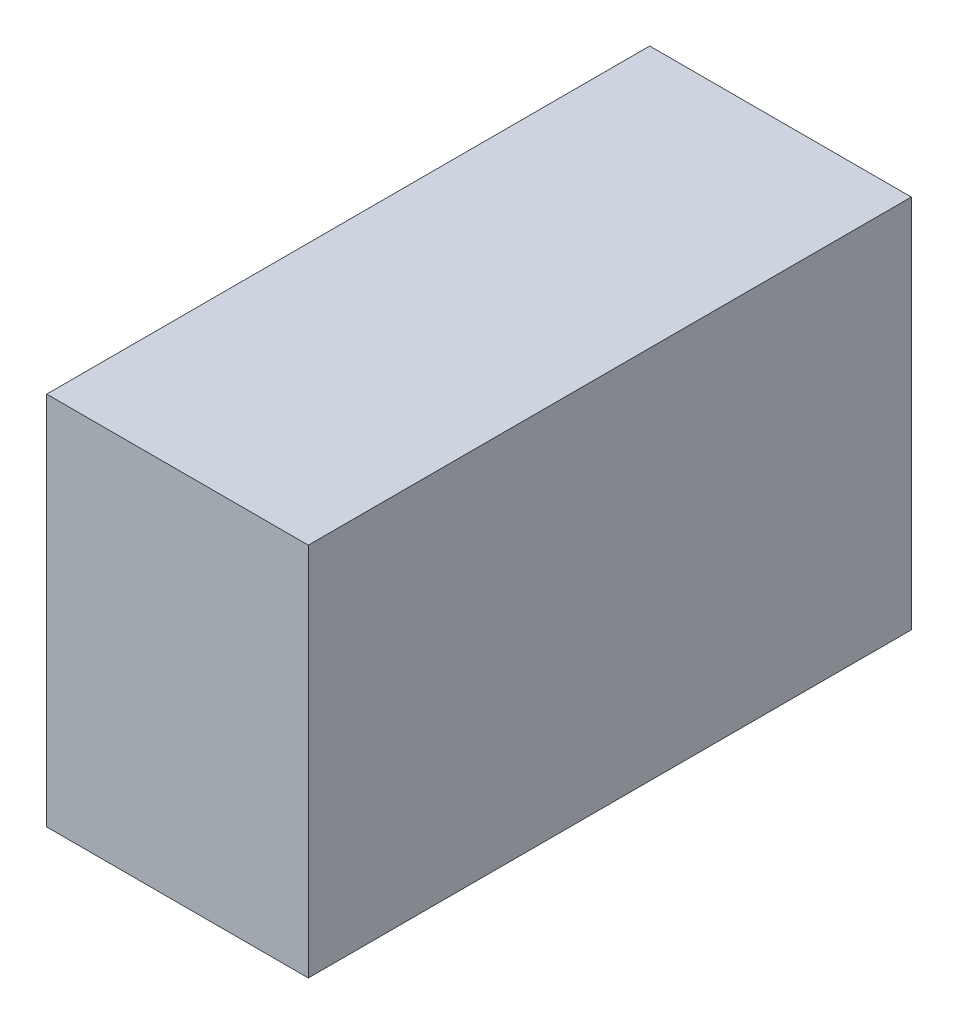
ISO-10303-21;
HEADER;
FILE_DESCRIPTION(('STEP AP214'),'2;1');
FILE_NAME('part.step','',(''),(''),'','','');
FILE_SCHEMA(('AUTOMOTIVE_DESIGN { 1 0 10303 214 1 1 1 1 }'));
ENDSEC;
DATA;
#1=APPLICATION_CONTEXT('core data for automotive mechanical design processes');
#2=APPLICATION_PROTOCOL_DEFINITION('international standard','automotive_design',2000,#1);
#3=PRODUCT_CONTEXT('',#1,'mechanical');
#4=PRODUCT('Part','Part','',(#3));
#5=PRODUCT_RELATED_PRODUCT_CATEGORY('part','',(#4));
#6=PRODUCT_DEFINITION_FORMATION('','',#4);
#7=PRODUCT_DEFINITION_CONTEXT('part definition',#1,'design');
#8=PRODUCT_DEFINITION('design','',#6,#7);
#9=PRODUCT_DEFINITION_SHAPE('','',#8);
#10=(LENGTH_UNIT() NAMED_UNIT(*) SI_UNIT(.MILLI.,.METRE.));
#11=(NAMED_UNIT(*) PLANE_ANGLE_UNIT() SI_UNIT($,.RADIAN.));
#12=(NAMED_UNIT(*) SI_UNIT($,.STERADIAN.) SOLID_ANGLE_UNIT());
#13=UNCERTAINTY_MEASURE_WITH_UNIT(LENGTH_MEASURE(1.E-05),#10,'distance_accuracy_value','');
#14=(GEOMETRIC_REPRESENTATION_CONTEXT(3) GLOBAL_UNCERTAINTY_ASSIGNED_CONTEXT((#13)) GLOBAL_UNIT_ASSIGNED_CONTEXT((#10,
#11,#12)) REPRESENTATION_CONTEXT('',''));
#15=CARTESIAN_POINT('',(0.,0.,0.));
#16=DIRECTION('',(0.,0.,1.));
#17=DIRECTION('',(1.,0.,0.));
#18=AXIS2_PLACEMENT_3D('',#15,#16,#17);
#19=CARTESIAN_POINT('',(32.8,94.,75.6));
#20=DIRECTION('',(-1.,0.,0.));
#21=DIRECTION('',(0.,0.,1.));
#22=AXIS2_PLACEMENT_3D('',#19,#20,#21);
#23=PLANE('',#22);
#24=DIRECTION('',(0.,0.,-1.));
#25=VECTOR('',#24,1.);
#26=CARTESIAN_POINT('',(32.8,0.,75.6));
#27=LINE('',#26,#25);
#28=CARTESIAN_POINT('',(32.8,0.,75.6));
#29=VERTEX_POINT('',#28);
#30=CARTESIAN_POINT('',(32.8,0.,-75.6));
#31=VERTEX_POINT('',#30);
#32=EDGE_CURVE('E99',#29,#31,#27,.T.);
#33=ORIENTED_EDGE('',*,*,#32,.T.);
#34=DIRECTION('',(0.,-1.,0.));
#35=VECTOR('',#34,1.);
#36=CARTESIAN_POINT('',(32.8,94.,-75.6));
#37=LINE('',#36,#35);
#38=CARTESIAN_POINT('',(32.8,94.,-75.6));
#39=VERTEX_POINT('',#38);
#40=EDGE_CURVE('E11',#39,#31,#37,.T.);
#41=ORIENTED_EDGE('',*,*,#40,.F.);
#42=DIRECTION('',(0.,0.,-1.));
#43=VECTOR('',#42,1.);
#44=CARTESIAN_POINT('',(32.8,94.,75.6));
#45=LINE('',#44,#43);
#46=CARTESIAN_POINT('',(32.8,94.,75.6));
#47=VERTEX_POINT('',#46);
#48=EDGE_CURVE('E87',#47,#39,#45,.T.);
#49=ORIENTED_EDGE('',*,*,#48,.F.);
#50=DIRECTION('',(0.,-1.,0.));
#51=VECTOR('',#50,1.);
#52=CARTESIAN_POINT('',(32.8,94.,75.6));
#53=LINE('',#52,#51);
#54=EDGE_CURVE('E95',#47,#29,#53,.T.);
#55=ORIENTED_EDGE('',*,*,#54,.T.);
#56=EDGE_LOOP('',(#33,#41,#49,#55));
#57=FACE_BOUND('',#56,.T.);
#58=ADVANCED_FACE('F36',(#57),#23,.F.);
#59=CARTESIAN_POINT('',(-32.8,94.,-75.6));
#60=DIRECTION('',(0.,0.,1.));
#61=DIRECTION('',(1.,0.,0.));
#62=AXIS2_PLACEMENT_3D('',#59,#60,#61);
#63=PLANE('',#62);
#64=DIRECTION('',(-1.,0.,0.));
#65=VECTOR('',#64,1.);
#66=CARTESIAN_POINT('',(-32.8,0.,-75.6));
#67=LINE('',#66,#65);
#68=CARTESIAN_POINT('',(-32.8,0.,-75.6));
#69=VERTEX_POINT('',#68);
#70=EDGE_CURVE('E91',#31,#69,#67,.T.);
#71=ORIENTED_EDGE('',*,*,#70,.T.);
#72=DIRECTION('',(0.,-1.,0.));
#73=VECTOR('',#72,1.);
#74=CARTESIAN_POINT('',(-32.8,94.,-75.6));
#75=LINE('',#74,#73);
#76=CARTESIAN_POINT('',(-32.8,94.,-75.6));
#77=VERTEX_POINT('',#76);
#78=EDGE_CURVE('E44',#77,#69,#75,.T.);
#79=ORIENTED_EDGE('',*,*,#78,.F.);
#80=DIRECTION('',(-1.,0.,0.));
#81=VECTOR('',#80,1.);
#82=CARTESIAN_POINT('',(-32.8,94.,-75.6));
#83=LINE('',#82,#81);
#84=EDGE_CURVE('E82',#39,#77,#83,.T.);
#85=ORIENTED_EDGE('',*,*,#84,.F.);
#86=ORIENTED_EDGE('',*,*,#40,.T.);
#87=EDGE_LOOP('',(#71,#79,#85,#86));
#88=FACE_BOUND('',#87,.T.);
#89=ADVANCED_FACE('F90',(#88),#63,.F.);
#90=CARTESIAN_POINT('',(-32.8,94.,75.6));
#91=DIRECTION('',(1.,0.,0.));
#92=DIRECTION('',(0.,0.,-1.));
#93=AXIS2_PLACEMENT_3D('',#90,#91,#92);
#94=PLANE('',#93);
#95=DIRECTION('',(0.,0.,1.));
#96=VECTOR('',#95,1.);
#97=CARTESIAN_POINT('',(-32.8,0.,75.6));
#98=LINE('',#97,#96);
#99=CARTESIAN_POINT('',(-32.8,0.,75.6));
#100=VERTEX_POINT('',#99);
#101=EDGE_CURVE('E69',#69,#100,#98,.T.);
#102=ORIENTED_EDGE('',*,*,#101,.T.);
#103=DIRECTION('',(0.,-1.,0.));
#104=VECTOR('',#103,1.);
#105=CARTESIAN_POINT('',(-32.8,94.,75.6));
#106=LINE('',#105,#104);
#107=CARTESIAN_POINT('',(-32.8,94.,75.6));
#108=VERTEX_POINT('',#107);
#109=EDGE_CURVE('E92',#108,#100,#106,.T.);
#110=ORIENTED_EDGE('',*,*,#109,.F.);
#111=DIRECTION('',(0.,0.,1.));
#112=VECTOR('',#111,1.);
#113=CARTESIAN_POINT('',(-32.8,94.,75.6));
#114=LINE('',#113,#112);
#115=EDGE_CURVE('E85',#77,#108,#114,.T.);
#116=ORIENTED_EDGE('',*,*,#115,.F.);
#117=ORIENTED_EDGE('',*,*,#78,.T.);
#118=EDGE_LOOP('',(#102,#110,#116,#117));
#119=FACE_BOUND('',#118,.T.);
#120=ADVANCED_FACE('F93',(#119),#94,.F.);
#121=CARTESIAN_POINT('',(-32.8,94.,75.6));
#122=DIRECTION('',(0.,0.,-1.));
#123=DIRECTION('',(-1.,0.,0.));
#124=AXIS2_PLACEMENT_3D('',#121,#122,#123);
#125=PLANE('',#124);
#126=DIRECTION('',(1.,0.,0.));
#127=VECTOR('',#126,1.);
#128=CARTESIAN_POINT('',(-32.8,0.,75.6));
#129=LINE('',#128,#127);
#130=EDGE_CURVE('E75',#100,#29,#129,.T.);
#131=ORIENTED_EDGE('',*,*,#130,.T.);
#132=ORIENTED_EDGE('',*,*,#54,.F.);
#133=DIRECTION('',(1.,0.,0.));
#134=VECTOR('',#133,1.);
#135=CARTESIAN_POINT('',(-32.8,94.,75.6));
#136=LINE('',#135,#134);
#137=EDGE_CURVE('E52',#108,#47,#136,.T.);
#138=ORIENTED_EDGE('',*,*,#137,.F.);
#139=ORIENTED_EDGE('',*,*,#109,.T.);
#140=EDGE_LOOP('',(#131,#132,#138,#139));
#141=FACE_BOUND('',#140,.T.);
#142=ADVANCED_FACE('F106',(#141),#125,.F.);
#143=CARTESIAN_POINT('',(0.,94.,0.));
#144=DIRECTION('',(0.,-1.,0.));
#145=DIRECTION('',(0.,0.,-1.));
#146=AXIS2_PLACEMENT_3D('',#143,#144,#145);
#147=PLANE('',#146);
#148=ORIENTED_EDGE('',*,*,#48,.T.);
#149=ORIENTED_EDGE('',*,*,#84,.T.);
#150=ORIENTED_EDGE('',*,*,#115,.T.);
#151=ORIENTED_EDGE('',*,*,#137,.T.);
#152=EDGE_LOOP('',(#148,#149,#150,#151));
#153=FACE_BOUND('',#152,.T.);
#154=ADVANCED_FACE('F83',(#153),#147,.F.);
#155=CARTESIAN_POINT('',(0.,0.,0.));
#156=DIRECTION('',(0.,-1.,0.));
#157=DIRECTION('',(0.,0.,-1.));
#158=AXIS2_PLACEMENT_3D('',#155,#156,#157);
#159=PLANE('',#158);
#160=ORIENTED_EDGE('',*,*,#32,.F.);
#161=ORIENTED_EDGE('',*,*,#130,.F.);
#162=ORIENTED_EDGE('',*,*,#101,.F.);
#163=ORIENTED_EDGE('',*,*,#70,.F.);
#164=EDGE_LOOP('',(#160,#161,#162,#163));
#165=FACE_BOUND('',#164,.T.);
#166=ADVANCED_FACE('F109',(#165),#159,.T.);
#167=CLOSED_SHELL('',(#58,#89,#120,#142,#154,#166));
#168=MANIFOLD_SOLID_BREP('B2',#167);
#169=ADVANCED_BREP_SHAPE_REPRESENTATION('',(#18,#168),#14);
#170=SHAPE_DEFINITION_REPRESENTATION(#9,#169);
ENDSEC;
END-ISO-10303-21;
